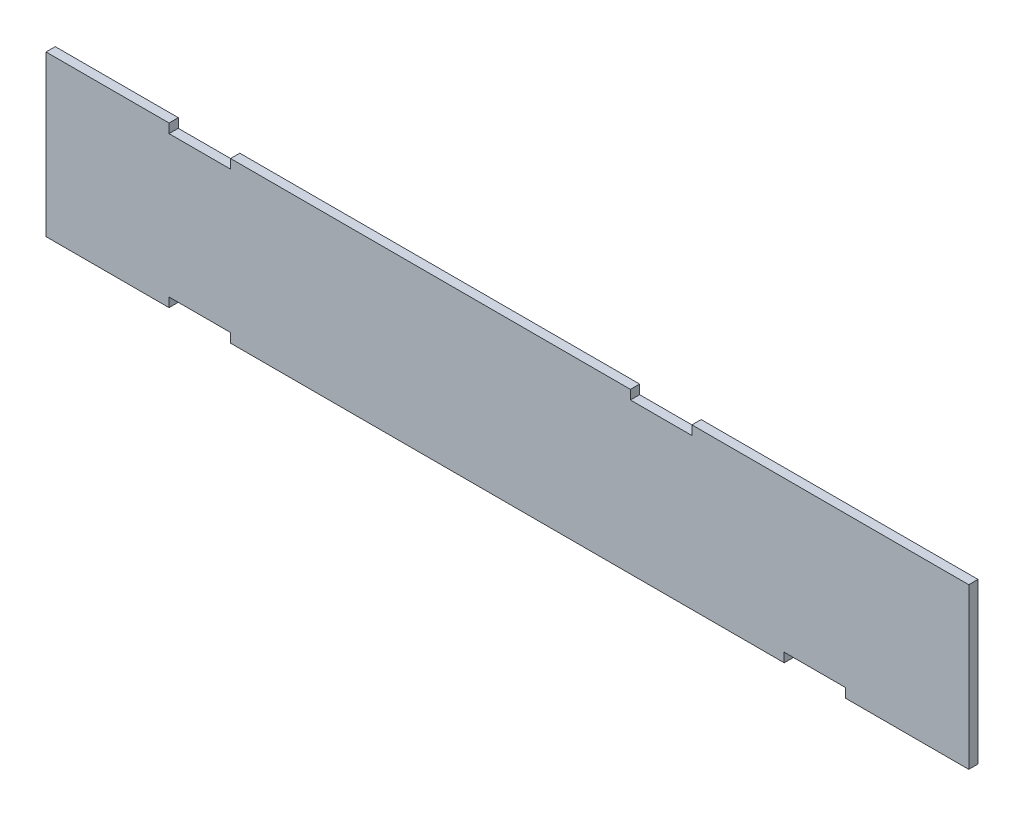
ISO-10303-21;
HEADER;
FILE_DESCRIPTION(('STEP AP214'),'2;1');
FILE_NAME('part.step','',(''),(''),'','','');
FILE_SCHEMA(('AUTOMOTIVE_DESIGN { 1 0 10303 214 1 1 1 1 }'));
ENDSEC;
DATA;
#1=APPLICATION_CONTEXT('core data for automotive mechanical design processes');
#2=APPLICATION_PROTOCOL_DEFINITION('international standard','automotive_design',2000,#1);
#3=PRODUCT_CONTEXT('',#1,'mechanical');
#4=PRODUCT('Part','Part','',(#3));
#5=PRODUCT_RELATED_PRODUCT_CATEGORY('part','',(#4));
#6=PRODUCT_DEFINITION_FORMATION('','',#4);
#7=PRODUCT_DEFINITION_CONTEXT('part definition',#1,'design');
#8=PRODUCT_DEFINITION('design','',#6,#7);
#9=PRODUCT_DEFINITION_SHAPE('','',#8);
#10=(LENGTH_UNIT() NAMED_UNIT(*) SI_UNIT(.MILLI.,.METRE.));
#11=(NAMED_UNIT(*) PLANE_ANGLE_UNIT() SI_UNIT($,.RADIAN.));
#12=(NAMED_UNIT(*) SI_UNIT($,.STERADIAN.) SOLID_ANGLE_UNIT());
#13=UNCERTAINTY_MEASURE_WITH_UNIT(LENGTH_MEASURE(1.E-05),#10,'distance_accuracy_value','');
#14=(GEOMETRIC_REPRESENTATION_CONTEXT(3) GLOBAL_UNCERTAINTY_ASSIGNED_CONTEXT((#13)) GLOBAL_UNIT_ASSIGNED_CONTEXT((#10,
#11,#12)) REPRESENTATION_CONTEXT('',''));
#15=CARTESIAN_POINT('',(0.,0.,0.));
#16=DIRECTION('',(0.,0.,1.));
#17=DIRECTION('',(1.,0.,0.));
#18=AXIS2_PLACEMENT_3D('',#15,#16,#17);
#19=CARTESIAN_POINT('',(150.,26.,3.));
#20=DIRECTION('',(0.,-1.,0.));
#21=DIRECTION('',(1.,0.,0.));
#22=AXIS2_PLACEMENT_3D('',#19,#20,#21);
#23=PLANE('',#22);
#24=DIRECTION('',(-1.,0.,0.));
#25=VECTOR('',#24,1.);
#26=CARTESIAN_POINT('',(150.,26.,0.));
#27=LINE('',#26,#25);
#28=CARTESIAN_POINT('',(150.,26.,0.));
#29=VERTEX_POINT('',#28);
#30=CARTESIAN_POINT('',(60.,26.,0.));
#31=VERTEX_POINT('',#30);
#32=EDGE_CURVE('E228',#29,#31,#27,.T.);
#33=ORIENTED_EDGE('',*,*,#32,.T.);
#34=DIRECTION('',(0.,0.,1.));
#35=VECTOR('',#34,1.);
#36=CARTESIAN_POINT('',(60.,26.,-7.));
#37=LINE('',#36,#35);
#38=CARTESIAN_POINT('',(60.,26.,3.));
#39=VERTEX_POINT('',#38);
#40=EDGE_CURVE('E297',#31,#39,#37,.T.);
#41=ORIENTED_EDGE('',*,*,#40,.T.);
#42=DIRECTION('',(-1.,0.,0.));
#43=VECTOR('',#42,1.);
#44=CARTESIAN_POINT('',(150.,26.,3.));
#45=LINE('',#44,#43);
#46=CARTESIAN_POINT('',(150.,26.,3.));
#47=VERTEX_POINT('',#46);
#48=EDGE_CURVE('E203',#47,#39,#45,.T.);
#49=ORIENTED_EDGE('',*,*,#48,.F.);
#50=DIRECTION('',(0.,0.,-1.));
#51=VECTOR('',#50,1.);
#52=CARTESIAN_POINT('',(150.,26.,3.));
#53=LINE('',#52,#51);
#54=EDGE_CURVE('E237',#47,#29,#53,.T.);
#55=ORIENTED_EDGE('',*,*,#54,.T.);
#56=EDGE_LOOP('',(#33,#41,#49,#55));
#57=FACE_BOUND('',#56,.T.);
#58=ADVANCED_FACE('F39',(#57),#23,.F.);
#59=CARTESIAN_POINT('',(150.,-26.,3.));
#60=DIRECTION('',(0.,1.,0.));
#61=DIRECTION('',(-1.,0.,0.));
#62=AXIS2_PLACEMENT_3D('',#59,#60,#61);
#63=PLANE('',#62);
#64=DIRECTION('',(1.,0.,0.));
#65=VECTOR('',#64,1.);
#66=CARTESIAN_POINT('',(150.,-26.,0.));
#67=LINE('',#66,#65);
#68=CARTESIAN_POINT('',(-150.,-26.,0.));
#69=VERTEX_POINT('',#68);
#70=CARTESIAN_POINT('',(-110.,-26.,0.));
#71=VERTEX_POINT('',#70);
#72=EDGE_CURVE('E219',#69,#71,#67,.T.);
#73=ORIENTED_EDGE('',*,*,#72,.T.);
#74=DIRECTION('',(0.,0.,1.));
#75=VECTOR('',#74,1.);
#76=CARTESIAN_POINT('',(-110.,-26.,-7.));
#77=LINE('',#76,#75);
#78=CARTESIAN_POINT('',(-110.,-26.,3.));
#79=VERTEX_POINT('',#78);
#80=EDGE_CURVE('E319',#71,#79,#77,.T.);
#81=ORIENTED_EDGE('',*,*,#80,.T.);
#82=DIRECTION('',(1.,0.,0.));
#83=VECTOR('',#82,1.);
#84=CARTESIAN_POINT('',(150.,-26.,3.));
#85=LINE('',#84,#83);
#86=CARTESIAN_POINT('',(-150.,-26.,3.));
#87=VERTEX_POINT('',#86);
#88=EDGE_CURVE('E377',#87,#79,#85,.T.);
#89=ORIENTED_EDGE('',*,*,#88,.F.);
#90=DIRECTION('',(0.,0.,-1.));
#91=VECTOR('',#90,1.);
#92=CARTESIAN_POINT('',(-150.,-26.,3.));
#93=LINE('',#92,#91);
#94=EDGE_CURVE('E245',#87,#69,#93,.T.);
#95=ORIENTED_EDGE('',*,*,#94,.T.);
#96=EDGE_LOOP('',(#73,#81,#89,#95));
#97=FACE_BOUND('',#96,.T.);
#98=ADVANCED_FACE('F416',(#97),#63,.F.);
#99=CARTESIAN_POINT('',(-90.,-26.,3.));
#100=VERTEX_POINT('',#99);
#101=CARTESIAN_POINT('',(90.,-26.,3.));
#102=VERTEX_POINT('',#101);
#103=EDGE_CURVE('E380',#100,#102,#85,.T.);
#104=ORIENTED_EDGE('',*,*,#103,.F.);
#105=DIRECTION('',(0.,0.,1.));
#106=VECTOR('',#105,1.);
#107=CARTESIAN_POINT('',(-90.,-26.,-7.));
#108=LINE('',#107,#106);
#109=CARTESIAN_POINT('',(-90.,-26.,0.));
#110=VERTEX_POINT('',#109);
#111=EDGE_CURVE('E318',#110,#100,#108,.T.);
#112=ORIENTED_EDGE('',*,*,#111,.F.);
#113=CARTESIAN_POINT('',(90.,-26.,0.));
#114=VERTEX_POINT('',#113);
#115=EDGE_CURVE('E224',#110,#114,#67,.T.);
#116=ORIENTED_EDGE('',*,*,#115,.T.);
#117=DIRECTION('',(0.,0.,1.));
#118=VECTOR('',#117,1.);
#119=CARTESIAN_POINT('',(90.,-26.,-7.));
#120=LINE('',#119,#118);
#121=EDGE_CURVE('E311',#114,#102,#120,.T.);
#122=ORIENTED_EDGE('',*,*,#121,.T.);
#123=EDGE_LOOP('',(#104,#112,#116,#122));
#124=FACE_BOUND('',#123,.T.);
#125=ADVANCED_FACE('F422',(#124),#63,.F.);
#126=CARTESIAN_POINT('',(40.,26.,3.));
#127=VERTEX_POINT('',#126);
#128=CARTESIAN_POINT('',(-90.,26.,3.));
#129=VERTEX_POINT('',#128);
#130=EDGE_CURVE('E192',#127,#129,#45,.T.);
#131=ORIENTED_EDGE('',*,*,#130,.F.);
#132=DIRECTION('',(0.,0.,1.));
#133=VECTOR('',#132,1.);
#134=CARTESIAN_POINT('',(40.,26.,-7.));
#135=LINE('',#134,#133);
#136=CARTESIAN_POINT('',(40.,26.,0.));
#137=VERTEX_POINT('',#136);
#138=EDGE_CURVE('E175',#137,#127,#135,.T.);
#139=ORIENTED_EDGE('',*,*,#138,.F.);
#140=CARTESIAN_POINT('',(-90.,26.,0.));
#141=VERTEX_POINT('',#140);
#142=EDGE_CURVE('E233',#137,#141,#27,.T.);
#143=ORIENTED_EDGE('',*,*,#142,.T.);
#144=DIRECTION('',(0.,0.,1.));
#145=VECTOR('',#144,1.);
#146=CARTESIAN_POINT('',(-90.,26.,-7.));
#147=LINE('',#146,#145);
#148=EDGE_CURVE('E201',#141,#129,#147,.T.);
#149=ORIENTED_EDGE('',*,*,#148,.T.);
#150=EDGE_LOOP('',(#131,#139,#143,#149));
#151=FACE_BOUND('',#150,.T.);
#152=ADVANCED_FACE('F199',(#151),#23,.F.);
#153=CARTESIAN_POINT('',(-150.,-26.,3.));
#154=DIRECTION('',(1.,0.,0.));
#155=DIRECTION('',(0.,0.,-1.));
#156=AXIS2_PLACEMENT_3D('',#153,#154,#155);
#157=PLANE('',#156);
#158=DIRECTION('',(0.,-1.,0.));
#159=VECTOR('',#158,1.);
#160=CARTESIAN_POINT('',(-150.,-26.,0.));
#161=LINE('',#160,#159);
#162=CARTESIAN_POINT('',(-150.,26.,0.));
#163=VERTEX_POINT('',#162);
#164=EDGE_CURVE('E214',#163,#69,#161,.T.);
#165=ORIENTED_EDGE('',*,*,#164,.T.);
#166=ORIENTED_EDGE('',*,*,#94,.F.);
#167=DIRECTION('',(0.,-1.,0.));
#168=VECTOR('',#167,1.);
#169=CARTESIAN_POINT('',(-150.,-26.,3.));
#170=LINE('',#169,#168);
#171=CARTESIAN_POINT('',(-150.,26.,3.));
#172=VERTEX_POINT('',#171);
#173=EDGE_CURVE('E232',#172,#87,#170,.T.);
#174=ORIENTED_EDGE('',*,*,#173,.F.);
#175=DIRECTION('',(0.,0.,-1.));
#176=VECTOR('',#175,1.);
#177=CARTESIAN_POINT('',(-150.,26.,3.));
#178=LINE('',#177,#176);
#179=EDGE_CURVE('E209',#172,#163,#178,.T.);
#180=ORIENTED_EDGE('',*,*,#179,.T.);
#181=EDGE_LOOP('',(#165,#166,#174,#180));
#182=FACE_BOUND('',#181,.T.);
#183=ADVANCED_FACE('F41',(#182),#157,.F.);
#184=CARTESIAN_POINT('',(110.,-26.,3.));
#185=VERTEX_POINT('',#184);
#186=CARTESIAN_POINT('',(150.,-26.,3.));
#187=VERTEX_POINT('',#186);
#188=EDGE_CURVE('E376',#185,#187,#85,.T.);
#189=ORIENTED_EDGE('',*,*,#188,.F.);
#190=DIRECTION('',(0.,0.,1.));
#191=VECTOR('',#190,1.);
#192=CARTESIAN_POINT('',(110.,-26.,-7.));
#193=LINE('',#192,#191);
#194=CARTESIAN_POINT('',(110.,-26.,0.));
#195=VERTEX_POINT('',#194);
#196=EDGE_CURVE('E341',#195,#185,#193,.T.);
#197=ORIENTED_EDGE('',*,*,#196,.F.);
#198=CARTESIAN_POINT('',(150.,-26.,0.));
#199=VERTEX_POINT('',#198);
#200=EDGE_CURVE('E218',#195,#199,#67,.T.);
#201=ORIENTED_EDGE('',*,*,#200,.T.);
#202=DIRECTION('',(0.,0.,-1.));
#203=VECTOR('',#202,1.);
#204=CARTESIAN_POINT('',(150.,-26.,3.));
#205=LINE('',#204,#203);
#206=EDGE_CURVE('E241',#187,#199,#205,.T.);
#207=ORIENTED_EDGE('',*,*,#206,.F.);
#208=EDGE_LOOP('',(#189,#197,#201,#207));
#209=FACE_BOUND('',#208,.T.);
#210=ADVANCED_FACE('F394',(#209),#63,.F.);
#211=CARTESIAN_POINT('',(150.,-26.,3.));
#212=DIRECTION('',(-1.,0.,0.));
#213=DIRECTION('',(0.,0.,1.));
#214=AXIS2_PLACEMENT_3D('',#211,#212,#213);
#215=PLANE('',#214);
#216=DIRECTION('',(0.,1.,0.));
#217=VECTOR('',#216,1.);
#218=CARTESIAN_POINT('',(150.,-26.,0.));
#219=LINE('',#218,#217);
#220=EDGE_CURVE('E223',#199,#29,#219,.T.);
#221=ORIENTED_EDGE('',*,*,#220,.T.);
#222=ORIENTED_EDGE('',*,*,#54,.F.);
#223=DIRECTION('',(0.,1.,0.));
#224=VECTOR('',#223,1.);
#225=CARTESIAN_POINT('',(150.,-26.,3.));
#226=LINE('',#225,#224);
#227=EDGE_CURVE('E210',#187,#47,#226,.T.);
#228=ORIENTED_EDGE('',*,*,#227,.F.);
#229=ORIENTED_EDGE('',*,*,#206,.T.);
#230=EDGE_LOOP('',(#221,#222,#228,#229));
#231=FACE_BOUND('',#230,.T.);
#232=ADVANCED_FACE('F398',(#231),#215,.F.);
#233=CARTESIAN_POINT('',(-110.,26.,3.));
#234=VERTEX_POINT('',#233);
#235=EDGE_CURVE('E204',#234,#172,#45,.T.);
#236=ORIENTED_EDGE('',*,*,#235,.F.);
#237=DIRECTION('',(0.,0.,1.));
#238=VECTOR('',#237,1.);
#239=CARTESIAN_POINT('',(-110.,26.,-7.));
#240=LINE('',#239,#238);
#241=CARTESIAN_POINT('',(-110.,26.,0.));
#242=VERTEX_POINT('',#241);
#243=EDGE_CURVE('E363',#242,#234,#240,.T.);
#244=ORIENTED_EDGE('',*,*,#243,.F.);
#245=EDGE_CURVE('E227',#242,#163,#27,.T.);
#246=ORIENTED_EDGE('',*,*,#245,.T.);
#247=ORIENTED_EDGE('',*,*,#179,.F.);
#248=EDGE_LOOP('',(#236,#244,#246,#247));
#249=FACE_BOUND('',#248,.T.);
#250=ADVANCED_FACE('F418',(#249),#23,.F.);
#251=CARTESIAN_POINT('',(0.,0.,3.));
#252=DIRECTION('',(0.,0.,1.));
#253=DIRECTION('',(1.,0.,0.));
#254=AXIS2_PLACEMENT_3D('',#251,#252,#253);
#255=PLANE('',#254);
#256=DIRECTION('',(0.,1.,0.));
#257=VECTOR('',#256,1.);
#258=CARTESIAN_POINT('',(60.,23.,3.));
#259=LINE('',#258,#257);
#260=CARTESIAN_POINT('',(60.,23.,3.));
#261=VERTEX_POINT('',#260);
#262=EDGE_CURVE('E186',#261,#39,#259,.T.);
#263=ORIENTED_EDGE('',*,*,#262,.F.);
#264=DIRECTION('',(1.,0.,0.));
#265=VECTOR('',#264,1.);
#266=CARTESIAN_POINT('',(40.,23.,3.));
#267=LINE('',#266,#265);
#268=CARTESIAN_POINT('',(40.,23.,3.));
#269=VERTEX_POINT('',#268);
#270=EDGE_CURVE('E195',#269,#261,#267,.T.);
#271=ORIENTED_EDGE('',*,*,#270,.F.);
#272=DIRECTION('',(0.,-1.,0.));
#273=VECTOR('',#272,1.);
#274=CARTESIAN_POINT('',(40.,26.,3.));
#275=LINE('',#274,#273);
#276=EDGE_CURVE('E178',#127,#269,#275,.T.);
#277=ORIENTED_EDGE('',*,*,#276,.F.);
#278=ORIENTED_EDGE('',*,*,#130,.T.);
#279=DIRECTION('',(0.,1.,0.));
#280=VECTOR('',#279,1.);
#281=CARTESIAN_POINT('',(-90.,23.,3.));
#282=LINE('',#281,#280);
#283=CARTESIAN_POINT('',(-90.,23.,3.));
#284=VERTEX_POINT('',#283);
#285=EDGE_CURVE('E360',#284,#129,#282,.T.);
#286=ORIENTED_EDGE('',*,*,#285,.F.);
#287=DIRECTION('',(1.,0.,0.));
#288=VECTOR('',#287,1.);
#289=CARTESIAN_POINT('',(-110.,23.,3.));
#290=LINE('',#289,#288);
#291=CARTESIAN_POINT('',(-110.,23.,3.));
#292=VERTEX_POINT('',#291);
#293=EDGE_CURVE('E356',#292,#284,#290,.T.);
#294=ORIENTED_EDGE('',*,*,#293,.F.);
#295=DIRECTION('',(0.,-1.,0.));
#296=VECTOR('',#295,1.);
#297=CARTESIAN_POINT('',(-110.,26.,3.));
#298=LINE('',#297,#296);
#299=EDGE_CURVE('E323',#234,#292,#298,.T.);
#300=ORIENTED_EDGE('',*,*,#299,.F.);
#301=ORIENTED_EDGE('',*,*,#235,.T.);
#302=ORIENTED_EDGE('',*,*,#173,.T.);
#303=ORIENTED_EDGE('',*,*,#88,.T.);
#304=DIRECTION('',(0.,-1.,0.));
#305=VECTOR('',#304,1.);
#306=CARTESIAN_POINT('',(-110.,-26.,3.));
#307=LINE('',#306,#305);
#308=CARTESIAN_POINT('',(-110.,-23.,3.));
#309=VERTEX_POINT('',#308);
#310=EDGE_CURVE('E315',#309,#79,#307,.T.);
#311=ORIENTED_EDGE('',*,*,#310,.F.);
#312=DIRECTION('',(-1.,0.,0.));
#313=VECTOR('',#312,1.);
#314=CARTESIAN_POINT('',(-110.,-23.,3.));
#315=LINE('',#314,#313);
#316=CARTESIAN_POINT('',(-90.,-23.,3.));
#317=VERTEX_POINT('',#316);
#318=EDGE_CURVE('E310',#317,#309,#315,.T.);
#319=ORIENTED_EDGE('',*,*,#318,.F.);
#320=DIRECTION('',(0.,1.,0.));
#321=VECTOR('',#320,1.);
#322=CARTESIAN_POINT('',(-90.,-23.,3.));
#323=LINE('',#322,#321);
#324=EDGE_CURVE('E307',#100,#317,#323,.T.);
#325=ORIENTED_EDGE('',*,*,#324,.F.);
#326=ORIENTED_EDGE('',*,*,#103,.T.);
#327=DIRECTION('',(0.,-1.,0.));
#328=VECTOR('',#327,1.);
#329=CARTESIAN_POINT('',(90.,-26.,3.));
#330=LINE('',#329,#328);
#331=CARTESIAN_POINT('',(90.,-23.,3.));
#332=VERTEX_POINT('',#331);
#333=EDGE_CURVE('E338',#332,#102,#330,.T.);
#334=ORIENTED_EDGE('',*,*,#333,.F.);
#335=DIRECTION('',(-1.,0.,0.));
#336=VECTOR('',#335,1.);
#337=CARTESIAN_POINT('',(90.,-23.,3.));
#338=LINE('',#337,#336);
#339=CARTESIAN_POINT('',(110.,-23.,3.));
#340=VERTEX_POINT('',#339);
#341=EDGE_CURVE('E334',#340,#332,#338,.T.);
#342=ORIENTED_EDGE('',*,*,#341,.F.);
#343=DIRECTION('',(0.,1.,0.));
#344=VECTOR('',#343,1.);
#345=CARTESIAN_POINT('',(110.,-23.,3.));
#346=LINE('',#345,#344);
#347=EDGE_CURVE('E302',#185,#340,#346,.T.);
#348=ORIENTED_EDGE('',*,*,#347,.F.);
#349=ORIENTED_EDGE('',*,*,#188,.T.);
#350=ORIENTED_EDGE('',*,*,#227,.T.);
#351=ORIENTED_EDGE('',*,*,#48,.T.);
#352=EDGE_LOOP('',(#263,#271,#277,#278,#286,#294,#300,#301,#302,#303,#311,#319,#325,#326,#334,
#342,#348,#349,#350,#351));
#353=FACE_BOUND('',#352,.T.);
#354=ADVANCED_FACE('F190',(#353),#255,.T.);
#355=CARTESIAN_POINT('',(0.,0.,0.));
#356=DIRECTION('',(0.,0.,1.));
#357=DIRECTION('',(1.,0.,0.));
#358=AXIS2_PLACEMENT_3D('',#355,#356,#357);
#359=PLANE('',#358);
#360=DIRECTION('',(1.,0.,0.));
#361=VECTOR('',#360,1.);
#362=CARTESIAN_POINT('',(0.,23.,0.));
#363=LINE('',#362,#361);
#364=CARTESIAN_POINT('',(40.,23.,0.));
#365=VERTEX_POINT('',#364);
#366=CARTESIAN_POINT('',(60.,23.,0.));
#367=VERTEX_POINT('',#366);
#368=EDGE_CURVE('E48',#365,#367,#363,.T.);
#369=ORIENTED_EDGE('',*,*,#368,.T.);
#370=DIRECTION('',(0.,1.,0.));
#371=VECTOR('',#370,1.);
#372=CARTESIAN_POINT('',(60.,0.,0.));
#373=LINE('',#372,#371);
#374=EDGE_CURVE('E11',#367,#31,#373,.T.);
#375=ORIENTED_EDGE('',*,*,#374,.T.);
#376=ORIENTED_EDGE('',*,*,#32,.F.);
#377=ORIENTED_EDGE('',*,*,#220,.F.);
#378=ORIENTED_EDGE('',*,*,#200,.F.);
#379=DIRECTION('',(0.,1.,0.));
#380=VECTOR('',#379,1.);
#381=CARTESIAN_POINT('',(110.,0.,0.));
#382=LINE('',#381,#380);
#383=CARTESIAN_POINT('',(110.,-23.,0.));
#384=VERTEX_POINT('',#383);
#385=EDGE_CURVE('E261',#195,#384,#382,.T.);
#386=ORIENTED_EDGE('',*,*,#385,.T.);
#387=DIRECTION('',(-1.,0.,0.));
#388=VECTOR('',#387,1.);
#389=CARTESIAN_POINT('',(0.,-23.,0.));
#390=LINE('',#389,#388);
#391=CARTESIAN_POINT('',(90.,-23.,0.));
#392=VERTEX_POINT('',#391);
#393=EDGE_CURVE('E265',#384,#392,#390,.T.);
#394=ORIENTED_EDGE('',*,*,#393,.T.);
#395=DIRECTION('',(0.,-1.,0.));
#396=VECTOR('',#395,1.);
#397=CARTESIAN_POINT('',(90.0000000000001,-4.16333634234434E-13,0.));
#398=LINE('',#397,#396);
#399=EDGE_CURVE('E269',#392,#114,#398,.T.);
#400=ORIENTED_EDGE('',*,*,#399,.T.);
#401=ORIENTED_EDGE('',*,*,#115,.F.);
#402=DIRECTION('',(0.,1.,0.));
#403=VECTOR('',#402,1.);
#404=CARTESIAN_POINT('',(-90.,0.,0.));
#405=LINE('',#404,#403);
#406=CARTESIAN_POINT('',(-90.,-23.,0.));
#407=VERTEX_POINT('',#406);
#408=EDGE_CURVE('E273',#110,#407,#405,.T.);
#409=ORIENTED_EDGE('',*,*,#408,.T.);
#410=DIRECTION('',(-1.,0.,0.));
#411=VECTOR('',#410,1.);
#412=CARTESIAN_POINT('',(0.,-23.,0.));
#413=LINE('',#412,#411);
#414=CARTESIAN_POINT('',(-110.,-23.,0.));
#415=VERTEX_POINT('',#414);
#416=EDGE_CURVE('E277',#407,#415,#413,.T.);
#417=ORIENTED_EDGE('',*,*,#416,.T.);
#418=DIRECTION('',(0.,-1.,0.));
#419=VECTOR('',#418,1.);
#420=CARTESIAN_POINT('',(-110.,0.,0.));
#421=LINE('',#420,#419);
#422=EDGE_CURVE('E281',#415,#71,#421,.T.);
#423=ORIENTED_EDGE('',*,*,#422,.T.);
#424=ORIENTED_EDGE('',*,*,#72,.F.);
#425=ORIENTED_EDGE('',*,*,#164,.F.);
#426=ORIENTED_EDGE('',*,*,#245,.F.);
#427=DIRECTION('',(0.,-1.,0.));
#428=VECTOR('',#427,1.);
#429=CARTESIAN_POINT('',(-110.,0.,0.));
#430=LINE('',#429,#428);
#431=CARTESIAN_POINT('',(-110.,23.,0.));
#432=VERTEX_POINT('',#431);
#433=EDGE_CURVE('E249',#242,#432,#430,.T.);
#434=ORIENTED_EDGE('',*,*,#433,.T.);
#435=DIRECTION('',(1.,0.,0.));
#436=VECTOR('',#435,1.);
#437=CARTESIAN_POINT('',(0.,23.,0.));
#438=LINE('',#437,#436);
#439=CARTESIAN_POINT('',(-90.,23.,0.));
#440=VERTEX_POINT('',#439);
#441=EDGE_CURVE('E253',#432,#440,#438,.T.);
#442=ORIENTED_EDGE('',*,*,#441,.T.);
#443=DIRECTION('',(0.,1.,0.));
#444=VECTOR('',#443,1.);
#445=CARTESIAN_POINT('',(-90.0000000000001,4.16333634234434E-13,0.));
#446=LINE('',#445,#444);
#447=EDGE_CURVE('E257',#440,#141,#446,.T.);
#448=ORIENTED_EDGE('',*,*,#447,.T.);
#449=ORIENTED_EDGE('',*,*,#142,.F.);
#450=DIRECTION('',(0.,-1.,0.));
#451=VECTOR('',#450,1.);
#452=CARTESIAN_POINT('',(40.,0.,0.));
#453=LINE('',#452,#451);
#454=EDGE_CURVE('E181',#137,#365,#453,.T.);
#455=ORIENTED_EDGE('',*,*,#454,.T.);
#456=EDGE_LOOP('',(#369,#375,#376,#377,#378,#386,#394,#400,#401,#409,#417,#423,#424,#425,#426,
#434,#442,#448,#449,#455));
#457=FACE_BOUND('',#456,.T.);
#458=ADVANCED_FACE('F289',(#457),#359,.F.);
#459=CARTESIAN_POINT('',(-90.,23.,-7.));
#460=DIRECTION('',(1.,0.,0.));
#461=DIRECTION('',(0.,1.,0.));
#462=AXIS2_PLACEMENT_3D('',#459,#460,#461);
#463=PLANE('',#462);
#464=DIRECTION('',(0.,0.,1.));
#465=VECTOR('',#464,1.);
#466=CARTESIAN_POINT('',(-90.,23.,-7.));
#467=LINE('',#466,#465);
#468=EDGE_CURVE('E366',#440,#284,#467,.T.);
#469=ORIENTED_EDGE('',*,*,#468,.T.);
#470=ORIENTED_EDGE('',*,*,#285,.T.);
#471=ORIENTED_EDGE('',*,*,#148,.F.);
#472=ORIENTED_EDGE('',*,*,#447,.F.);
#473=EDGE_LOOP('',(#469,#470,#471,#472));
#474=FACE_BOUND('',#473,.T.);
#475=ADVANCED_FACE('F449',(#474),#463,.F.);
#476=CARTESIAN_POINT('',(-110.,23.,-7.));
#477=DIRECTION('',(0.,-1.,0.));
#478=DIRECTION('',(0.,0.,-1.));
#479=AXIS2_PLACEMENT_3D('',#476,#477,#478);
#480=PLANE('',#479);
#481=DIRECTION('',(0.,0.,1.));
#482=VECTOR('',#481,1.);
#483=CARTESIAN_POINT('',(-110.,23.,-7.));
#484=LINE('',#483,#482);
#485=EDGE_CURVE('E369',#432,#292,#484,.T.);
#486=ORIENTED_EDGE('',*,*,#485,.T.);
#487=ORIENTED_EDGE('',*,*,#293,.T.);
#488=ORIENTED_EDGE('',*,*,#468,.F.);
#489=ORIENTED_EDGE('',*,*,#441,.F.);
#490=EDGE_LOOP('',(#486,#487,#488,#489));
#491=FACE_BOUND('',#490,.T.);
#492=ADVANCED_FACE('F452',(#491),#480,.F.);
#493=CARTESIAN_POINT('',(-110.,26.,-7.));
#494=DIRECTION('',(-1.,0.,0.));
#495=DIRECTION('',(0.,0.,1.));
#496=AXIS2_PLACEMENT_3D('',#493,#494,#495);
#497=PLANE('',#496);
#498=ORIENTED_EDGE('',*,*,#243,.T.);
#499=ORIENTED_EDGE('',*,*,#299,.T.);
#500=ORIENTED_EDGE('',*,*,#485,.F.);
#501=ORIENTED_EDGE('',*,*,#433,.F.);
#502=EDGE_LOOP('',(#498,#499,#500,#501));
#503=FACE_BOUND('',#502,.T.);
#504=ADVANCED_FACE('F443',(#503),#497,.F.);
#505=CARTESIAN_POINT('',(90.,-26.,-7.));
#506=DIRECTION('',(-1.,0.,0.));
#507=DIRECTION('',(0.,-1.,0.));
#508=AXIS2_PLACEMENT_3D('',#505,#506,#507);
#509=PLANE('',#508);
#510=DIRECTION('',(0.,0.,1.));
#511=VECTOR('',#510,1.);
#512=CARTESIAN_POINT('',(90.,-23.,-7.));
#513=LINE('',#512,#511);
#514=EDGE_CURVE('E345',#392,#332,#513,.T.);
#515=ORIENTED_EDGE('',*,*,#514,.T.);
#516=ORIENTED_EDGE('',*,*,#333,.T.);
#517=ORIENTED_EDGE('',*,*,#121,.F.);
#518=ORIENTED_EDGE('',*,*,#399,.F.);
#519=EDGE_LOOP('',(#515,#516,#517,#518));
#520=FACE_BOUND('',#519,.T.);
#521=ADVANCED_FACE('F459',(#520),#509,.F.);
#522=CARTESIAN_POINT('',(90.,-23.,-7.));
#523=DIRECTION('',(0.,1.,0.));
#524=DIRECTION('',(0.,0.,1.));
#525=AXIS2_PLACEMENT_3D('',#522,#523,#524);
#526=PLANE('',#525);
#527=DIRECTION('',(0.,0.,1.));
#528=VECTOR('',#527,1.);
#529=CARTESIAN_POINT('',(110.,-23.,-7.));
#530=LINE('',#529,#528);
#531=EDGE_CURVE('E348',#384,#340,#530,.T.);
#532=ORIENTED_EDGE('',*,*,#531,.T.);
#533=ORIENTED_EDGE('',*,*,#341,.T.);
#534=ORIENTED_EDGE('',*,*,#514,.F.);
#535=ORIENTED_EDGE('',*,*,#393,.F.);
#536=EDGE_LOOP('',(#532,#533,#534,#535));
#537=FACE_BOUND('',#536,.T.);
#538=ADVANCED_FACE('F519',(#537),#526,.F.);
#539=CARTESIAN_POINT('',(110.,-23.,-7.));
#540=DIRECTION('',(1.,0.,0.));
#541=DIRECTION('',(0.,0.,-1.));
#542=AXIS2_PLACEMENT_3D('',#539,#540,#541);
#543=PLANE('',#542);
#544=ORIENTED_EDGE('',*,*,#196,.T.);
#545=ORIENTED_EDGE('',*,*,#347,.T.);
#546=ORIENTED_EDGE('',*,*,#531,.F.);
#547=ORIENTED_EDGE('',*,*,#385,.F.);
#548=EDGE_LOOP('',(#544,#545,#546,#547));
#549=FACE_BOUND('',#548,.T.);
#550=ADVANCED_FACE('F529',(#549),#543,.F.);
#551=CARTESIAN_POINT('',(-110.,-26.,-7.));
#552=DIRECTION('',(-1.,0.,0.));
#553=DIRECTION('',(0.,0.,1.));
#554=AXIS2_PLACEMENT_3D('',#551,#552,#553);
#555=PLANE('',#554);
#556=DIRECTION('',(0.,0.,1.));
#557=VECTOR('',#556,1.);
#558=CARTESIAN_POINT('',(-110.,-23.,-7.));
#559=LINE('',#558,#557);
#560=EDGE_CURVE('E324',#415,#309,#559,.T.);
#561=ORIENTED_EDGE('',*,*,#560,.T.);
#562=ORIENTED_EDGE('',*,*,#310,.T.);
#563=ORIENTED_EDGE('',*,*,#80,.F.);
#564=ORIENTED_EDGE('',*,*,#422,.F.);
#565=EDGE_LOOP('',(#561,#562,#563,#564));
#566=FACE_BOUND('',#565,.T.);
#567=ADVANCED_FACE('F539',(#566),#555,.F.);
#568=CARTESIAN_POINT('',(-110.,-23.,-7.));
#569=DIRECTION('',(0.,1.,0.));
#570=DIRECTION('',(0.,0.,1.));
#571=AXIS2_PLACEMENT_3D('',#568,#569,#570);
#572=PLANE('',#571);
#573=DIRECTION('',(0.,0.,1.));
#574=VECTOR('',#573,1.);
#575=CARTESIAN_POINT('',(-90.,-23.,-7.));
#576=LINE('',#575,#574);
#577=EDGE_CURVE('E63',#407,#317,#576,.T.);
#578=ORIENTED_EDGE('',*,*,#577,.T.);
#579=ORIENTED_EDGE('',*,*,#318,.T.);
#580=ORIENTED_EDGE('',*,*,#560,.F.);
#581=ORIENTED_EDGE('',*,*,#416,.F.);
#582=EDGE_LOOP('',(#578,#579,#580,#581));
#583=FACE_BOUND('',#582,.T.);
#584=ADVANCED_FACE('F413',(#583),#572,.F.);
#585=CARTESIAN_POINT('',(-90.,-23.,-7.));
#586=DIRECTION('',(1.,0.,0.));
#587=DIRECTION('',(0.,0.,-1.));
#588=AXIS2_PLACEMENT_3D('',#585,#586,#587);
#589=PLANE('',#588);
#590=ORIENTED_EDGE('',*,*,#111,.T.);
#591=ORIENTED_EDGE('',*,*,#324,.T.);
#592=ORIENTED_EDGE('',*,*,#577,.F.);
#593=ORIENTED_EDGE('',*,*,#408,.F.);
#594=EDGE_LOOP('',(#590,#591,#592,#593));
#595=FACE_BOUND('',#594,.T.);
#596=ADVANCED_FACE('F406',(#595),#589,.F.);
#597=CARTESIAN_POINT('',(60.,23.,-7.));
#598=DIRECTION('',(1.,0.,0.));
#599=DIRECTION('',(0.,0.,-1.));
#600=AXIS2_PLACEMENT_3D('',#597,#598,#599);
#601=PLANE('',#600);
#602=DIRECTION('',(0.,0.,1.));
#603=VECTOR('',#602,1.);
#604=CARTESIAN_POINT('',(60.,23.,-7.));
#605=LINE('',#604,#603);
#606=EDGE_CURVE('E294',#367,#261,#605,.T.);
#607=ORIENTED_EDGE('',*,*,#606,.T.);
#608=ORIENTED_EDGE('',*,*,#262,.T.);
#609=ORIENTED_EDGE('',*,*,#40,.F.);
#610=ORIENTED_EDGE('',*,*,#374,.F.);
#611=EDGE_LOOP('',(#607,#608,#609,#610));
#612=FACE_BOUND('',#611,.T.);
#613=ADVANCED_FACE('F404',(#612),#601,.F.);
#614=CARTESIAN_POINT('',(40.,23.,-7.));
#615=DIRECTION('',(0.,-1.,0.));
#616=DIRECTION('',(0.,0.,-1.));
#617=AXIS2_PLACEMENT_3D('',#614,#615,#616);
#618=PLANE('',#617);
#619=DIRECTION('',(0.,0.,1.));
#620=VECTOR('',#619,1.);
#621=CARTESIAN_POINT('',(40.,23.,-7.));
#622=LINE('',#621,#620);
#623=EDGE_CURVE('E55',#365,#269,#622,.T.);
#624=ORIENTED_EDGE('',*,*,#623,.T.);
#625=ORIENTED_EDGE('',*,*,#270,.T.);
#626=ORIENTED_EDGE('',*,*,#606,.F.);
#627=ORIENTED_EDGE('',*,*,#368,.F.);
#628=EDGE_LOOP('',(#624,#625,#626,#627));
#629=FACE_BOUND('',#628,.T.);
#630=ADVANCED_FACE('F293',(#629),#618,.F.);
#631=CARTESIAN_POINT('',(40.,26.,-7.));
#632=DIRECTION('',(-1.,0.,0.));
#633=DIRECTION('',(0.,0.,1.));
#634=AXIS2_PLACEMENT_3D('',#631,#632,#633);
#635=PLANE('',#634);
#636=ORIENTED_EDGE('',*,*,#138,.T.);
#637=ORIENTED_EDGE('',*,*,#276,.T.);
#638=ORIENTED_EDGE('',*,*,#623,.F.);
#639=ORIENTED_EDGE('',*,*,#454,.F.);
#640=EDGE_LOOP('',(#636,#637,#638,#639));
#641=FACE_BOUND('',#640,.T.);
#642=ADVANCED_FACE('F177',(#641),#635,.F.);
#643=CLOSED_SHELL('',(#58,#98,#125,#152,#183,#210,#232,#250,#354,#458,#475,#492,#504,#521,#538,
#550,#567,#584,#596,#613,#630,#642));
#644=MANIFOLD_SOLID_BREP('B2',#643);
#645=ADVANCED_BREP_SHAPE_REPRESENTATION('',(#18,#644),#14);
#646=SHAPE_DEFINITION_REPRESENTATION(#9,#645);
ENDSEC;
END-ISO-10303-21;
